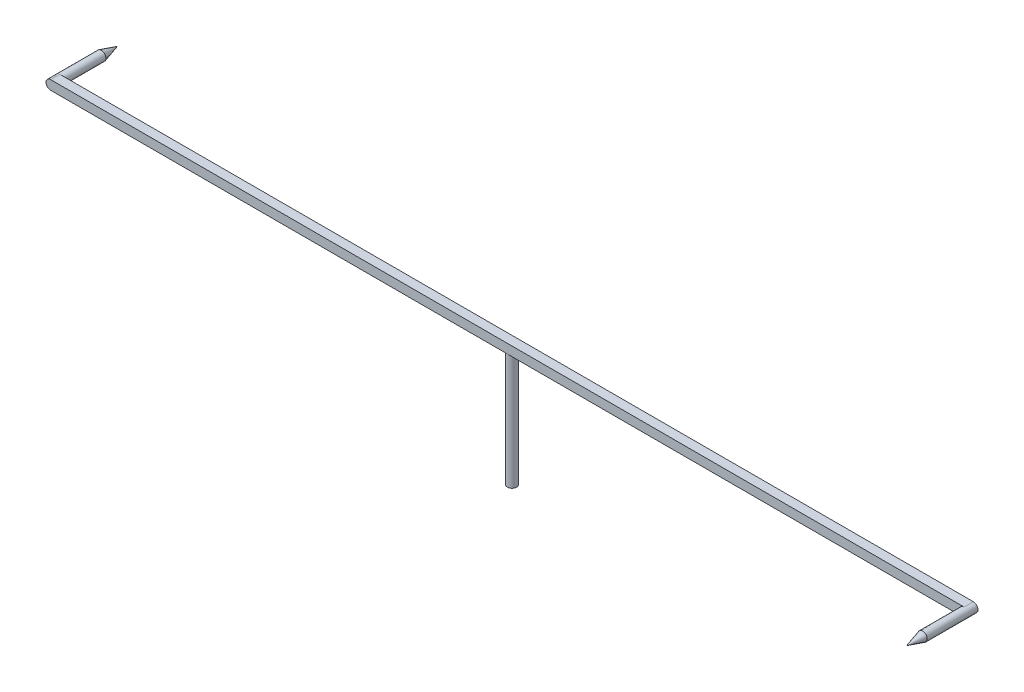
ISO-10303-21;
HEADER;
FILE_DESCRIPTION(('STEP AP214'),'2;1');
FILE_NAME('part.step','',(''),(''),'','','');
FILE_SCHEMA(('AUTOMOTIVE_DESIGN { 1 0 10303 214 1 1 1 1 }'));
ENDSEC;
DATA;
#1=APPLICATION_CONTEXT('core data for automotive mechanical design processes');
#2=APPLICATION_PROTOCOL_DEFINITION('international standard','automotive_design',2000,#1);
#3=PRODUCT_CONTEXT('',#1,'mechanical');
#4=PRODUCT('Part','Part','',(#3));
#5=PRODUCT_RELATED_PRODUCT_CATEGORY('part','',(#4));
#6=PRODUCT_DEFINITION_FORMATION('','',#4);
#7=PRODUCT_DEFINITION_CONTEXT('part definition',#1,'design');
#8=PRODUCT_DEFINITION('design','',#6,#7);
#9=PRODUCT_DEFINITION_SHAPE('','',#8);
#10=(LENGTH_UNIT() NAMED_UNIT(*) SI_UNIT(.MILLI.,.METRE.));
#11=(NAMED_UNIT(*) PLANE_ANGLE_UNIT() SI_UNIT($,.RADIAN.));
#12=(NAMED_UNIT(*) SI_UNIT($,.STERADIAN.) SOLID_ANGLE_UNIT());
#13=UNCERTAINTY_MEASURE_WITH_UNIT(LENGTH_MEASURE(1.E-05),#10,'distance_accuracy_value','');
#14=(GEOMETRIC_REPRESENTATION_CONTEXT(3) GLOBAL_UNCERTAINTY_ASSIGNED_CONTEXT((#13)) GLOBAL_UNIT_ASSIGNED_CONTEXT((#10,
#11,#12)) REPRESENTATION_CONTEXT('',''));
#15=CARTESIAN_POINT('',(0.,0.,0.));
#16=DIRECTION('',(0.,0.,1.));
#17=DIRECTION('',(1.,0.,0.));
#18=AXIS2_PLACEMENT_3D('',#15,#16,#17);
#19=CARTESIAN_POINT('',(0.,10.,0.));
#20=DIRECTION('',(0.,-1.,0.));
#21=DIRECTION('',(0.,0.,-1.));
#22=AXIS2_PLACEMENT_3D('',#19,#20,#21);
#23=CYLINDRICAL_SURFACE('',#22,0.4);
#24=CARTESIAN_POINT('',(0.,10.,0.));
#25=DIRECTION('',(0.,1.,0.));
#26=DIRECTION('',(0.,0.,1.));
#27=AXIS2_PLACEMENT_3D('',#24,#25,#26);
#28=CIRCLE('',#27,0.4);
#29=CARTESIAN_POINT('',(0.,10.,0.4));
#30=VERTEX_POINT('',#29);
#31=CARTESIAN_POINT('',(0.,10.,-0.4));
#32=VERTEX_POINT('',#31);
#33=EDGE_CURVE('E166',#30,#32,#28,.T.);
#34=ORIENTED_EDGE('',*,*,#33,.F.);
#35=EDGE_CURVE('E170',#32,#30,#28,.T.);
#36=ORIENTED_EDGE('',*,*,#35,.F.);
#37=EDGE_LOOP('',(#34,#36));
#38=FACE_BOUND('',#37,.T.);
#39=CARTESIAN_POINT('',(0.,0.,0.));
#40=DIRECTION('',(0.,1.,0.));
#41=DIRECTION('',(0.,0.,1.));
#42=AXIS2_PLACEMENT_3D('',#39,#40,#41);
#43=CIRCLE('',#42,0.4);
#44=CARTESIAN_POINT('',(0.,0.,0.4));
#45=VERTEX_POINT('',#44);
#46=EDGE_CURVE('E160',#45,#45,#43,.T.);
#47=ORIENTED_EDGE('',*,*,#46,.T.);
#48=EDGE_LOOP('',(#47));
#49=FACE_BOUND('',#48,.T.);
#50=ADVANCED_FACE('F39',(#38,#49),#23,.T.);
#51=CARTESIAN_POINT('',(0.,0.,0.));
#52=DIRECTION('',(0.,1.,0.));
#53=DIRECTION('',(0.,0.,1.));
#54=AXIS2_PLACEMENT_3D('',#51,#52,#53);
#55=PLANE('',#54);
#56=ORIENTED_EDGE('',*,*,#46,.F.);
#57=EDGE_LOOP('',(#56));
#58=FACE_BOUND('',#57,.T.);
#59=ADVANCED_FACE('F116',(#58),#55,.F.);
#60=CARTESIAN_POINT('',(0.,10.,0.));
#61=DIRECTION('',(0.,1.,0.));
#62=DIRECTION('',(0.,0.,1.));
#63=AXIS2_PLACEMENT_3D('',#60,#61,#62);
#64=PLANE('',#63);
#65=DIRECTION('',(-1.,0.,0.));
#66=VECTOR('',#65,1.);
#67=CARTESIAN_POINT('',(-40.,10.,-0.4));
#68=LINE('',#67,#66);
#69=CARTESIAN_POINT('',(39.6,10.,-0.4));
#70=VERTEX_POINT('',#69);
#71=EDGE_CURVE('E158',#70,#32,#68,.T.);
#72=ORIENTED_EDGE('',*,*,#71,.F.);
#73=DIRECTION('',(0.,0.,-1.));
#74=VECTOR('',#73,1.);
#75=CARTESIAN_POINT('',(39.6,10.,0.));
#76=LINE('',#75,#74);
#77=CARTESIAN_POINT('',(39.6,10.,0.4));
#78=VERTEX_POINT('',#77);
#79=EDGE_CURVE('E11',#70,#78,#76,.F.);
#80=ORIENTED_EDGE('',*,*,#79,.T.);
#81=DIRECTION('',(1.,0.,0.));
#82=VECTOR('',#81,1.);
#83=CARTESIAN_POINT('',(-40.,10.,0.4));
#84=LINE('',#83,#82);
#85=EDGE_CURVE('E164',#30,#78,#84,.T.);
#86=ORIENTED_EDGE('',*,*,#85,.F.);
#87=ORIENTED_EDGE('',*,*,#33,.T.);
#88=EDGE_LOOP('',(#72,#80,#86,#87));
#89=FACE_BOUND('',#88,.T.);
#90=ADVANCED_FACE('F122',(#89),#64,.F.);
#91=CARTESIAN_POINT('',(-39.6,10.,0.4));
#92=VERTEX_POINT('',#91);
#93=EDGE_CURVE('E161',#92,#30,#84,.T.);
#94=ORIENTED_EDGE('',*,*,#93,.F.);
#95=DIRECTION('',(0.,0.,1.));
#96=VECTOR('',#95,1.);
#97=CARTESIAN_POINT('',(-39.6,10.,0.));
#98=LINE('',#97,#96);
#99=CARTESIAN_POINT('',(-39.6,10.,-0.4));
#100=VERTEX_POINT('',#99);
#101=EDGE_CURVE('E176',#92,#100,#98,.F.);
#102=ORIENTED_EDGE('',*,*,#101,.T.);
#103=EDGE_CURVE('E163',#32,#100,#68,.T.);
#104=ORIENTED_EDGE('',*,*,#103,.F.);
#105=ORIENTED_EDGE('',*,*,#35,.T.);
#106=EDGE_LOOP('',(#94,#102,#104,#105));
#107=FACE_BOUND('',#106,.T.);
#108=ADVANCED_FACE('F199',(#107),#64,.F.);
#109=CARTESIAN_POINT('',(-40.,10.8,0.4));
#110=DIRECTION('',(0.,0.,-1.));
#111=DIRECTION('',(-1.,0.,0.));
#112=AXIS2_PLACEMENT_3D('',#109,#110,#111);
#113=PLANE('',#112);
#114=CARTESIAN_POINT('',(39.6,10.4,0.4));
#115=DIRECTION('',(0.,0.,1.));
#116=DIRECTION('',(1.,0.,0.));
#117=AXIS2_PLACEMENT_3D('',#114,#115,#116);
#118=CIRCLE('',#117,0.399999999999998);
#119=CARTESIAN_POINT('',(39.6,10.8,0.4));
#120=VERTEX_POINT('',#119);
#121=EDGE_CURVE('E145',#120,#78,#118,.T.);
#122=ORIENTED_EDGE('',*,*,#121,.F.);
#123=DIRECTION('',(1.,0.,0.));
#124=VECTOR('',#123,1.);
#125=CARTESIAN_POINT('',(-40.,10.8,0.4));
#126=LINE('',#125,#124);
#127=CARTESIAN_POINT('',(-39.6,10.8,0.4));
#128=VERTEX_POINT('',#127);
#129=EDGE_CURVE('E154',#128,#120,#126,.T.);
#130=ORIENTED_EDGE('',*,*,#129,.F.);
#131=CARTESIAN_POINT('',(-39.6,10.4,0.4));
#132=DIRECTION('',(0.,0.,-1.));
#133=DIRECTION('',(-1.,0.,0.));
#134=AXIS2_PLACEMENT_3D('',#131,#132,#133);
#135=CIRCLE('',#134,0.4);
#136=CARTESIAN_POINT('',(-40.,10.4,0.4));
#137=VERTEX_POINT('',#136);
#138=EDGE_CURVE('E169',#128,#137,#135,.F.);
#139=ORIENTED_EDGE('',*,*,#138,.T.);
#140=CARTESIAN_POINT('',(-39.6,10.4,0.4));
#141=DIRECTION('',(0.,0.,-1.));
#142=DIRECTION('',(-1.,0.,0.));
#143=AXIS2_PLACEMENT_3D('',#140,#141,#142);
#144=CIRCLE('',#143,0.4);
#145=EDGE_CURVE('E174',#137,#92,#144,.F.);
#146=ORIENTED_EDGE('',*,*,#145,.T.);
#147=ORIENTED_EDGE('',*,*,#93,.T.);
#148=ORIENTED_EDGE('',*,*,#85,.T.);
#149=EDGE_LOOP('',(#122,#130,#139,#146,#147,#148));
#150=FACE_BOUND('',#149,.T.);
#151=ADVANCED_FACE('F202',(#150),#113,.F.);
#152=CARTESIAN_POINT('',(-40.,10.8,-0.4));
#153=DIRECTION('',(0.,0.,1.));
#154=DIRECTION('',(1.,0.,0.));
#155=AXIS2_PLACEMENT_3D('',#152,#153,#154);
#156=PLANE('',#155);
#157=CARTESIAN_POINT('',(-39.6,10.4,-0.4));
#158=DIRECTION('',(0.,0.,-1.));
#159=DIRECTION('',(-1.,0.,0.));
#160=AXIS2_PLACEMENT_3D('',#157,#158,#159);
#161=CIRCLE('',#160,0.399999999999998);
#162=CARTESIAN_POINT('',(-39.6,10.8,-0.4));
#163=VERTEX_POINT('',#162);
#164=EDGE_CURVE('E62',#163,#100,#161,.T.);
#165=ORIENTED_EDGE('',*,*,#164,.F.);
#166=DIRECTION('',(-1.,0.,0.));
#167=VECTOR('',#166,1.);
#168=CARTESIAN_POINT('',(-40.,10.8,-0.4));
#169=LINE('',#168,#167);
#170=CARTESIAN_POINT('',(39.6,10.8,-0.4));
#171=VERTEX_POINT('',#170);
#172=EDGE_CURVE('E157',#171,#163,#169,.T.);
#173=ORIENTED_EDGE('',*,*,#172,.F.);
#174=CARTESIAN_POINT('',(39.6,10.4,-0.4));
#175=DIRECTION('',(0.,0.,1.));
#176=DIRECTION('',(1.,0.,0.));
#177=AXIS2_PLACEMENT_3D('',#174,#175,#176);
#178=CIRCLE('',#177,0.4);
#179=CARTESIAN_POINT('',(40.,10.4,-0.4));
#180=VERTEX_POINT('',#179);
#181=EDGE_CURVE('E56',#171,#180,#178,.F.);
#182=ORIENTED_EDGE('',*,*,#181,.T.);
#183=CARTESIAN_POINT('',(39.6,10.4,-0.4));
#184=DIRECTION('',(0.,0.,1.));
#185=DIRECTION('',(1.,0.,0.));
#186=AXIS2_PLACEMENT_3D('',#183,#184,#185);
#187=CIRCLE('',#186,0.4);
#188=EDGE_CURVE('E179',#180,#70,#187,.F.);
#189=ORIENTED_EDGE('',*,*,#188,.T.);
#190=ORIENTED_EDGE('',*,*,#71,.T.);
#191=ORIENTED_EDGE('',*,*,#103,.T.);
#192=EDGE_LOOP('',(#165,#173,#182,#189,#190,#191));
#193=FACE_BOUND('',#192,.T.);
#194=ADVANCED_FACE('F137',(#193),#156,.F.);
#195=CARTESIAN_POINT('',(0.,10.8,0.));
#196=DIRECTION('',(0.,1.,0.));
#197=DIRECTION('',(0.,0.,1.));
#198=AXIS2_PLACEMENT_3D('',#195,#196,#197);
#199=PLANE('',#198);
#200=ORIENTED_EDGE('',*,*,#172,.T.);
#201=DIRECTION('',(0.,0.,1.));
#202=VECTOR('',#201,1.);
#203=CARTESIAN_POINT('',(-39.6,10.8,0.4));
#204=LINE('',#203,#202);
#205=EDGE_CURVE('E48',#163,#128,#204,.T.);
#206=ORIENTED_EDGE('',*,*,#205,.T.);
#207=ORIENTED_EDGE('',*,*,#129,.T.);
#208=DIRECTION('',(0.,0.,-1.));
#209=VECTOR('',#208,1.);
#210=CARTESIAN_POINT('',(39.6,10.8,-0.4));
#211=LINE('',#210,#209);
#212=EDGE_CURVE('E181',#120,#171,#211,.T.);
#213=ORIENTED_EDGE('',*,*,#212,.T.);
#214=EDGE_LOOP('',(#200,#206,#207,#213));
#215=FACE_BOUND('',#214,.T.);
#216=ADVANCED_FACE('F130',(#215),#199,.T.);
#217=CARTESIAN_POINT('',(-39.6,10.4,0.));
#218=DIRECTION('',(0.,0.,-1.));
#219=DIRECTION('',(-1.,0.,0.));
#220=AXIS2_PLACEMENT_3D('',#217,#218,#219);
#221=CYLINDRICAL_SURFACE('',#220,0.4);
#222=ORIENTED_EDGE('',*,*,#205,.F.);
#223=ORIENTED_EDGE('',*,*,#164,.T.);
#224=ORIENTED_EDGE('',*,*,#101,.F.);
#225=ORIENTED_EDGE('',*,*,#145,.F.);
#226=DIRECTION('',(0.,0.,1.));
#227=VECTOR('',#226,1.);
#228=CARTESIAN_POINT('',(-40.,10.4,-0.4));
#229=LINE('',#228,#227);
#230=CARTESIAN_POINT('',(-40.,10.4,-0.4));
#231=VERTEX_POINT('',#230);
#232=EDGE_CURVE('E183',#137,#231,#229,.F.);
#233=ORIENTED_EDGE('',*,*,#232,.T.);
#234=ORIENTED_EDGE('',*,*,#232,.F.);
#235=ORIENTED_EDGE('',*,*,#138,.F.);
#236=EDGE_LOOP('',(#222,#223,#224,#225,#233,#234,#235));
#237=FACE_BOUND('',#236,.T.);
#238=CARTESIAN_POINT('',(-39.6,10.4,-4.));
#239=DIRECTION('',(0.,0.,-1.));
#240=DIRECTION('',(-1.,0.,0.));
#241=AXIS2_PLACEMENT_3D('',#238,#239,#240);
#242=CIRCLE('',#241,0.399999999999998);
#243=CARTESIAN_POINT('',(-40.,10.4,-4.));
#244=VERTEX_POINT('',#243);
#245=EDGE_CURVE('E144',#244,#244,#242,.T.);
#246=ORIENTED_EDGE('',*,*,#245,.F.);
#247=EDGE_LOOP('',(#246));
#248=FACE_BOUND('',#247,.T.);
#249=ADVANCED_FACE('F128',(#237,#248),#221,.T.);
#250=CARTESIAN_POINT('',(39.6,10.4,0.));
#251=DIRECTION('',(0.,0.,1.));
#252=DIRECTION('',(1.,0.,0.));
#253=AXIS2_PLACEMENT_3D('',#250,#251,#252);
#254=CYLINDRICAL_SURFACE('',#253,0.4);
#255=ORIENTED_EDGE('',*,*,#212,.F.);
#256=ORIENTED_EDGE('',*,*,#121,.T.);
#257=ORIENTED_EDGE('',*,*,#79,.F.);
#258=ORIENTED_EDGE('',*,*,#188,.F.);
#259=DIRECTION('',(0.,0.,-1.));
#260=VECTOR('',#259,1.);
#261=CARTESIAN_POINT('',(40.,10.4,0.4));
#262=LINE('',#261,#260);
#263=CARTESIAN_POINT('',(40.,10.4,0.4));
#264=VERTEX_POINT('',#263);
#265=EDGE_CURVE('E43',#180,#264,#262,.F.);
#266=ORIENTED_EDGE('',*,*,#265,.T.);
#267=ORIENTED_EDGE('',*,*,#265,.F.);
#268=ORIENTED_EDGE('',*,*,#181,.F.);
#269=EDGE_LOOP('',(#255,#256,#257,#258,#266,#267,#268));
#270=FACE_BOUND('',#269,.T.);
#271=CARTESIAN_POINT('',(39.6,10.4,4.));
#272=DIRECTION('',(0.,0.,1.));
#273=DIRECTION('',(1.,0.,0.));
#274=AXIS2_PLACEMENT_3D('',#271,#272,#273);
#275=CIRCLE('',#274,0.399999999999998);
#276=CARTESIAN_POINT('',(40.,10.4,4.));
#277=VERTEX_POINT('',#276);
#278=EDGE_CURVE('E148',#277,#277,#275,.T.);
#279=ORIENTED_EDGE('',*,*,#278,.F.);
#280=EDGE_LOOP('',(#279));
#281=FACE_BOUND('',#280,.T.);
#282=ADVANCED_FACE('F41',(#270,#281),#254,.T.);
#283=CARTESIAN_POINT('',(39.6,10.4,5.4));
#284=DIRECTION('',(0.,0.,-1.));
#285=DIRECTION('',(-1.,0.,0.));
#286=AXIS2_PLACEMENT_3D('',#283,#284,#285);
#287=CONICAL_SURFACE('',#286,0.,0.27829965900511);
#288=ORIENTED_EDGE('',*,*,#278,.T.);
#289=EDGE_LOOP('',(#288));
#290=FACE_BOUND('',#289,.T.);
#291=CARTESIAN_POINT('',(39.6,10.4,5.4));
#292=VERTEX_POINT('',#291);
#293=VERTEX_LOOP('',#292);
#294=FACE_BOUND('',#293,.T.);
#295=ADVANCED_FACE('F106',(#290,#294),#287,.T.);
#296=CARTESIAN_POINT('',(-39.6,10.4,-5.4));
#297=DIRECTION('',(0.,0.,1.));
#298=DIRECTION('',(1.,0.,0.));
#299=AXIS2_PLACEMENT_3D('',#296,#297,#298);
#300=CONICAL_SURFACE('',#299,0.,0.27829965900511);
#301=ORIENTED_EDGE('',*,*,#245,.T.);
#302=EDGE_LOOP('',(#301));
#303=FACE_BOUND('',#302,.T.);
#304=CARTESIAN_POINT('',(-39.6,10.4,-5.4));
#305=VERTEX_POINT('',#304);
#306=VERTEX_LOOP('',#305);
#307=FACE_BOUND('',#306,.T.);
#308=ADVANCED_FACE('F104',(#303,#307),#300,.T.);
#309=CLOSED_SHELL('',(#50,#59,#90,#108,#151,#194,#216,#249,#282,#295,#308));
#310=MANIFOLD_SOLID_BREP('B2',#309);
#311=ADVANCED_BREP_SHAPE_REPRESENTATION('',(#18,#310),#14);
#312=SHAPE_DEFINITION_REPRESENTATION(#9,#311);
ENDSEC;
END-ISO-10303-21;
